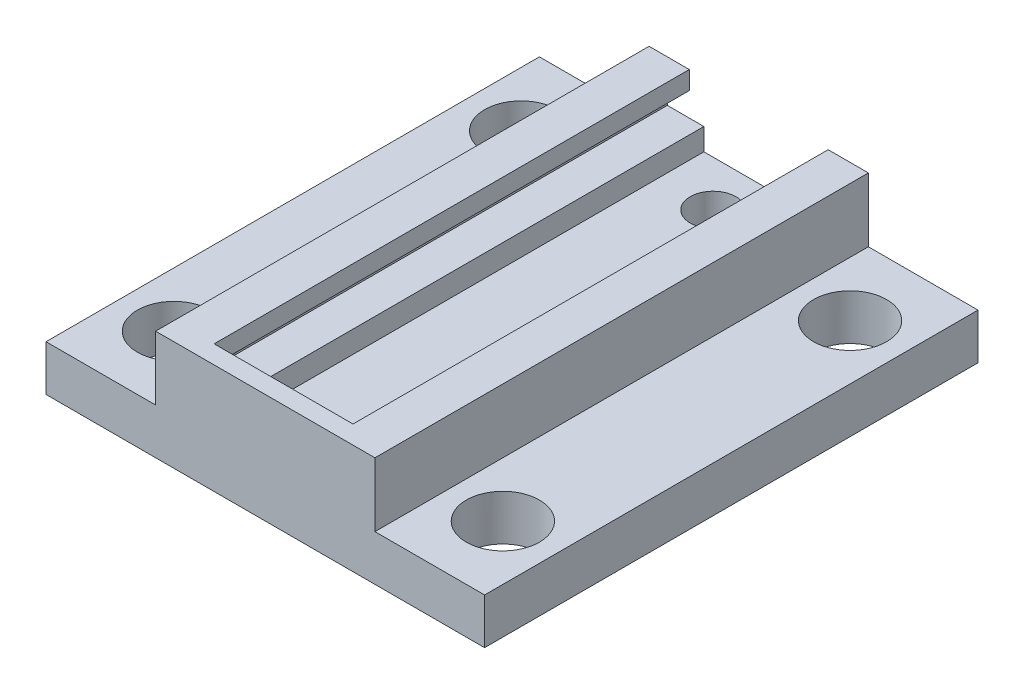
ISO-10303-21;
HEADER;
FILE_DESCRIPTION(('STEP AP214'),'2;1');
FILE_NAME('part.step','',(''),(''),'','','');
FILE_SCHEMA(('AUTOMOTIVE_DESIGN { 1 0 10303 214 1 1 1 1 }'));
ENDSEC;
DATA;
#1=APPLICATION_CONTEXT('core data for automotive mechanical design processes');
#2=APPLICATION_PROTOCOL_DEFINITION('international standard','automotive_design',2000,#1);
#3=PRODUCT_CONTEXT('',#1,'mechanical');
#4=PRODUCT('Part','Part','',(#3));
#5=PRODUCT_RELATED_PRODUCT_CATEGORY('part','',(#4));
#6=PRODUCT_DEFINITION_FORMATION('','',#4);
#7=PRODUCT_DEFINITION_CONTEXT('part definition',#1,'design');
#8=PRODUCT_DEFINITION('design','',#6,#7);
#9=PRODUCT_DEFINITION_SHAPE('','',#8);
#10=(LENGTH_UNIT() NAMED_UNIT(*) SI_UNIT(.MILLI.,.METRE.));
#11=(NAMED_UNIT(*) PLANE_ANGLE_UNIT() SI_UNIT($,.RADIAN.));
#12=(NAMED_UNIT(*) SI_UNIT($,.STERADIAN.) SOLID_ANGLE_UNIT());
#13=UNCERTAINTY_MEASURE_WITH_UNIT(LENGTH_MEASURE(1.E-05),#10,'distance_accuracy_value','');
#14=(GEOMETRIC_REPRESENTATION_CONTEXT(3) GLOBAL_UNCERTAINTY_ASSIGNED_CONTEXT((#13)) GLOBAL_UNIT_ASSIGNED_CONTEXT((#10,
#11,#12)) REPRESENTATION_CONTEXT('',''));
#15=CARTESIAN_POINT('',(0.,0.,0.));
#16=DIRECTION('',(0.,0.,1.));
#17=DIRECTION('',(1.,0.,0.));
#18=AXIS2_PLACEMENT_3D('',#15,#16,#17);
#19=CARTESIAN_POINT('',(4.826,-0.0160928441834901,34.29));
#20=DIRECTION('',(1.,0.,0.));
#21=DIRECTION('',(0.,0.,-1.));
#22=AXIS2_PLACEMENT_3D('',#19,#20,#21);
#23=PLANE('',#22);
#24=DIRECTION('',(0.,-1.,0.));
#25=VECTOR('',#24,1.);
#26=CARTESIAN_POINT('',(4.826,-0.0160928441834901,33.02));
#27=LINE('',#26,#25);
#28=CARTESIAN_POINT('',(4.826,1.25390715581651,33.02));
#29=VERTEX_POINT('',#28);
#30=CARTESIAN_POINT('',(4.826,-0.0160928441834901,33.02));
#31=VERTEX_POINT('',#30);
#32=EDGE_CURVE('E199',#29,#31,#27,.T.);
#33=ORIENTED_EDGE('',*,*,#32,.F.);
#34=DIRECTION('',(0.,0.,-1.));
#35=VECTOR('',#34,1.);
#36=CARTESIAN_POINT('',(4.826,1.25390715581651,34.29));
#37=LINE('',#36,#35);
#38=CARTESIAN_POINT('',(4.826,1.25390715581651,0.));
#39=VERTEX_POINT('',#38);
#40=EDGE_CURVE('E186',#29,#39,#37,.T.);
#41=ORIENTED_EDGE('',*,*,#40,.T.);
#42=DIRECTION('',(0.,-1.,0.));
#43=VECTOR('',#42,1.);
#44=CARTESIAN_POINT('',(4.826,-0.0160928441834901,0.));
#45=LINE('',#44,#43);
#46=CARTESIAN_POINT('',(4.826,-0.0160928441834901,0.));
#47=VERTEX_POINT('',#46);
#48=EDGE_CURVE('E218',#39,#47,#45,.T.);
#49=ORIENTED_EDGE('',*,*,#48,.T.);
#50=DIRECTION('',(0.,0.,-1.));
#51=VECTOR('',#50,1.);
#52=CARTESIAN_POINT('',(4.826,-0.0160928441834901,34.29));
#53=LINE('',#52,#51);
#54=EDGE_CURVE('E303',#31,#47,#53,.T.);
#55=ORIENTED_EDGE('',*,*,#54,.F.);
#56=EDGE_LOOP('',(#33,#41,#49,#55));
#57=FACE_BOUND('',#56,.T.);
#58=ADVANCED_FACE('F51',(#57),#23,.F.);
#59=CARTESIAN_POINT('',(6.35,-0.0160928441834901,34.29));
#60=DIRECTION('',(0.,1.,0.));
#61=DIRECTION('',(0.,0.,1.));
#62=AXIS2_PLACEMENT_3D('',#59,#60,#61);
#63=PLANE('',#62);
#64=DIRECTION('',(1.,0.,0.));
#65=VECTOR('',#64,1.);
#66=CARTESIAN_POINT('',(6.35,-0.0160928441834901,33.02));
#67=LINE('',#66,#65);
#68=CARTESIAN_POINT('',(6.35,-0.0160928441834901,33.02));
#69=VERTEX_POINT('',#68);
#70=EDGE_CURVE('E390',#31,#69,#67,.T.);
#71=ORIENTED_EDGE('',*,*,#70,.F.);
#72=ORIENTED_EDGE('',*,*,#54,.T.);
#73=DIRECTION('',(1.,0.,0.));
#74=VECTOR('',#73,1.);
#75=CARTESIAN_POINT('',(6.35,-0.0160928441834901,0.));
#76=LINE('',#75,#74);
#77=CARTESIAN_POINT('',(6.35,-0.0160928441834901,0.));
#78=VERTEX_POINT('',#77);
#79=EDGE_CURVE('E222',#47,#78,#76,.T.);
#80=ORIENTED_EDGE('',*,*,#79,.T.);
#81=DIRECTION('',(0.,0.,-1.));
#82=VECTOR('',#81,1.);
#83=CARTESIAN_POINT('',(6.35,-0.0160928441834901,34.29));
#84=LINE('',#83,#82);
#85=EDGE_CURVE('E300',#69,#78,#84,.T.);
#86=ORIENTED_EDGE('',*,*,#85,.F.);
#87=EDGE_LOOP('',(#71,#72,#80,#86));
#88=FACE_BOUND('',#87,.T.);
#89=ADVANCED_FACE('F439',(#88),#63,.F.);
#90=CARTESIAN_POINT('',(6.35,-1.66709284418349,34.29));
#91=DIRECTION('',(1.,0.,0.));
#92=DIRECTION('',(0.,0.,-1.));
#93=AXIS2_PLACEMENT_3D('',#90,#91,#92);
#94=PLANE('',#93);
#95=DIRECTION('',(0.,-1.,0.));
#96=VECTOR('',#95,1.);
#97=CARTESIAN_POINT('',(6.35,-1.66709284418349,33.02));
#98=LINE('',#97,#96);
#99=CARTESIAN_POINT('',(6.35,-1.66709284418349,33.02));
#100=VERTEX_POINT('',#99);
#101=EDGE_CURVE('E386',#69,#100,#98,.T.);
#102=ORIENTED_EDGE('',*,*,#101,.F.);
#103=ORIENTED_EDGE('',*,*,#85,.T.);
#104=DIRECTION('',(0.,-1.,0.));
#105=VECTOR('',#104,1.);
#106=CARTESIAN_POINT('',(6.35,-1.66709284418349,0.));
#107=LINE('',#106,#105);
#108=CARTESIAN_POINT('',(6.35,-1.66709284418349,0.));
#109=VERTEX_POINT('',#108);
#110=EDGE_CURVE('E226',#78,#109,#107,.T.);
#111=ORIENTED_EDGE('',*,*,#110,.T.);
#112=DIRECTION('',(0.,0.,-1.));
#113=VECTOR('',#112,1.);
#114=CARTESIAN_POINT('',(6.35,-1.66709284418349,34.29));
#115=LINE('',#114,#113);
#116=EDGE_CURVE('E297',#100,#109,#115,.T.);
#117=ORIENTED_EDGE('',*,*,#116,.F.);
#118=EDGE_LOOP('',(#102,#103,#111,#117));
#119=FACE_BOUND('',#118,.T.);
#120=ADVANCED_FACE('F443',(#119),#94,.F.);
#121=CARTESIAN_POINT('',(3.81,-1.66709284418349,34.29));
#122=DIRECTION('',(0.,-1.,0.));
#123=DIRECTION('',(0.,0.,-1.));
#124=AXIS2_PLACEMENT_3D('',#121,#122,#123);
#125=PLANE('',#124);
#126=DIRECTION('',(-1.,0.,0.));
#127=VECTOR('',#126,1.);
#128=CARTESIAN_POINT('',(3.81,-1.66709284418349,33.02));
#129=LINE('',#128,#127);
#130=CARTESIAN_POINT('',(3.81,-1.66709284418349,33.02));
#131=VERTEX_POINT('',#130);
#132=EDGE_CURVE('E382',#100,#131,#129,.T.);
#133=ORIENTED_EDGE('',*,*,#132,.F.);
#134=ORIENTED_EDGE('',*,*,#116,.T.);
#135=DIRECTION('',(-1.,0.,0.));
#136=VECTOR('',#135,1.);
#137=CARTESIAN_POINT('',(3.81,-1.66709284418349,0.));
#138=LINE('',#137,#136);
#139=CARTESIAN_POINT('',(3.81,-1.66709284418349,0.));
#140=VERTEX_POINT('',#139);
#141=EDGE_CURVE('E230',#109,#140,#138,.T.);
#142=ORIENTED_EDGE('',*,*,#141,.T.);
#143=DIRECTION('',(0.,0.,-1.));
#144=VECTOR('',#143,1.);
#145=CARTESIAN_POINT('',(3.81,-1.66709284418349,34.29));
#146=LINE('',#145,#144);
#147=EDGE_CURVE('E294',#131,#140,#146,.T.);
#148=ORIENTED_EDGE('',*,*,#147,.F.);
#149=EDGE_LOOP('',(#133,#134,#142,#148));
#150=FACE_BOUND('',#149,.T.);
#151=ADVANCED_FACE('F452',(#150),#125,.F.);
#152=CARTESIAN_POINT('',(3.81,-3.19109284418349,34.29));
#153=DIRECTION('',(1.,0.,0.));
#154=DIRECTION('',(0.,1.,0.));
#155=AXIS2_PLACEMENT_3D('',#152,#153,#154);
#156=PLANE('',#155);
#157=DIRECTION('',(0.,-1.,0.));
#158=VECTOR('',#157,1.);
#159=CARTESIAN_POINT('',(3.81,-3.19109284418349,33.02));
#160=LINE('',#159,#158);
#161=CARTESIAN_POINT('',(3.81,-3.19109284418349,33.02));
#162=VERTEX_POINT('',#161);
#163=EDGE_CURVE('E378',#131,#162,#160,.T.);
#164=ORIENTED_EDGE('',*,*,#163,.F.);
#165=ORIENTED_EDGE('',*,*,#147,.T.);
#166=DIRECTION('',(0.,-1.,0.));
#167=VECTOR('',#166,1.);
#168=CARTESIAN_POINT('',(3.81,-3.19109284418349,0.));
#169=LINE('',#168,#167);
#170=CARTESIAN_POINT('',(3.81,-3.19109284418349,0.));
#171=VERTEX_POINT('',#170);
#172=EDGE_CURVE('E234',#140,#171,#169,.T.);
#173=ORIENTED_EDGE('',*,*,#172,.T.);
#174=DIRECTION('',(0.,0.,-1.));
#175=VECTOR('',#174,1.);
#176=CARTESIAN_POINT('',(3.81,-3.19109284418349,34.29));
#177=LINE('',#176,#175);
#178=EDGE_CURVE('E291',#162,#171,#177,.T.);
#179=ORIENTED_EDGE('',*,*,#178,.F.);
#180=EDGE_LOOP('',(#164,#165,#173,#179));
#181=FACE_BOUND('',#180,.T.);
#182=ADVANCED_FACE('F457',(#181),#156,.F.);
#183=CARTESIAN_POINT('',(3.81,-3.19109284418349,34.29));
#184=DIRECTION('',(0.,-1.,0.));
#185=DIRECTION('',(0.,0.,-1.));
#186=AXIS2_PLACEMENT_3D('',#183,#184,#185);
#187=PLANE('',#186);
#188=CARTESIAN_POINT('',(0.,-3.19109284418349,3.175));
#189=DIRECTION('',(0.,1.,0.));
#190=DIRECTION('',(0.,0.,1.));
#191=AXIS2_PLACEMENT_3D('',#188,#189,#190);
#192=CIRCLE('',#191,1.5875);
#193=CARTESIAN_POINT('',(0.,-3.19109284418349,4.7625));
#194=VERTEX_POINT('',#193);
#195=EDGE_CURVE('E742',#194,#194,#192,.T.);
#196=ORIENTED_EDGE('',*,*,#195,.F.);
#197=EDGE_LOOP('',(#196));
#198=FACE_BOUND('',#197,.T.);
#199=DIRECTION('',(1.,0.,0.));
#200=VECTOR('',#199,1.);
#201=CARTESIAN_POINT('',(-7.62,-3.19109284418349,33.02));
#202=LINE('',#201,#200);
#203=CARTESIAN_POINT('',(-3.81,-3.19109284418349,33.02));
#204=VERTEX_POINT('',#203);
#205=EDGE_CURVE('E350',#204,#162,#202,.T.);
#206=ORIENTED_EDGE('',*,*,#205,.T.);
#207=ORIENTED_EDGE('',*,*,#178,.T.);
#208=DIRECTION('',(-1.,0.,0.));
#209=VECTOR('',#208,1.);
#210=CARTESIAN_POINT('',(3.81,-3.19109284418349,0.));
#211=LINE('',#210,#209);
#212=CARTESIAN_POINT('',(-3.81,-3.19109284418349,0.));
#213=VERTEX_POINT('',#212);
#214=EDGE_CURVE('E238',#171,#213,#211,.T.);
#215=ORIENTED_EDGE('',*,*,#214,.T.);
#216=DIRECTION('',(0.,0.,-1.));
#217=VECTOR('',#216,1.);
#218=CARTESIAN_POINT('',(-3.81,-3.19109284418349,34.29));
#219=LINE('',#218,#217);
#220=EDGE_CURVE('E288',#204,#213,#219,.T.);
#221=ORIENTED_EDGE('',*,*,#220,.F.);
#222=EDGE_LOOP('',(#206,#207,#215,#221));
#223=FACE_BOUND('',#222,.T.);
#224=ADVANCED_FACE('F466',(#198,#223),#187,.F.);
#225=CARTESIAN_POINT('',(-3.81,-3.19109284418349,34.29));
#226=DIRECTION('',(-1.,0.,0.));
#227=DIRECTION('',(0.,-1.,0.));
#228=AXIS2_PLACEMENT_3D('',#225,#226,#227);
#229=PLANE('',#228);
#230=DIRECTION('',(0.,1.,0.));
#231=VECTOR('',#230,1.);
#232=CARTESIAN_POINT('',(-3.81,-3.19109284418349,33.02));
#233=LINE('',#232,#231);
#234=CARTESIAN_POINT('',(-3.81,-1.66709284418349,33.02));
#235=VERTEX_POINT('',#234);
#236=EDGE_CURVE('E374',#204,#235,#233,.T.);
#237=ORIENTED_EDGE('',*,*,#236,.F.);
#238=ORIENTED_EDGE('',*,*,#220,.T.);
#239=DIRECTION('',(0.,1.,0.));
#240=VECTOR('',#239,1.);
#241=CARTESIAN_POINT('',(-3.81,-3.19109284418349,0.));
#242=LINE('',#241,#240);
#243=CARTESIAN_POINT('',(-3.81,-1.66709284418349,0.));
#244=VERTEX_POINT('',#243);
#245=EDGE_CURVE('E242',#213,#244,#242,.T.);
#246=ORIENTED_EDGE('',*,*,#245,.T.);
#247=DIRECTION('',(0.,0.,-1.));
#248=VECTOR('',#247,1.);
#249=CARTESIAN_POINT('',(-3.81,-1.66709284418349,34.29));
#250=LINE('',#249,#248);
#251=EDGE_CURVE('E285',#235,#244,#250,.T.);
#252=ORIENTED_EDGE('',*,*,#251,.F.);
#253=EDGE_LOOP('',(#237,#238,#246,#252));
#254=FACE_BOUND('',#253,.T.);
#255=ADVANCED_FACE('F470',(#254),#229,.F.);
#256=CARTESIAN_POINT('',(-3.81,-1.66709284418349,34.29));
#257=DIRECTION('',(0.,-1.,0.));
#258=DIRECTION('',(0.,0.,-1.));
#259=AXIS2_PLACEMENT_3D('',#256,#257,#258);
#260=PLANE('',#259);
#261=DIRECTION('',(-1.,0.,0.));
#262=VECTOR('',#261,1.);
#263=CARTESIAN_POINT('',(-3.81,-1.66709284418349,33.02));
#264=LINE('',#263,#262);
#265=CARTESIAN_POINT('',(-6.35,-1.66709284418349,33.02));
#266=VERTEX_POINT('',#265);
#267=EDGE_CURVE('E370',#235,#266,#264,.T.);
#268=ORIENTED_EDGE('',*,*,#267,.F.);
#269=ORIENTED_EDGE('',*,*,#251,.T.);
#270=DIRECTION('',(-1.,0.,0.));
#271=VECTOR('',#270,1.);
#272=CARTESIAN_POINT('',(-3.81,-1.66709284418349,0.));
#273=LINE('',#272,#271);
#274=CARTESIAN_POINT('',(-6.35,-1.66709284418349,0.));
#275=VERTEX_POINT('',#274);
#276=EDGE_CURVE('E246',#244,#275,#273,.T.);
#277=ORIENTED_EDGE('',*,*,#276,.T.);
#278=DIRECTION('',(0.,0.,-1.));
#279=VECTOR('',#278,1.);
#280=CARTESIAN_POINT('',(-6.35,-1.66709284418349,34.29));
#281=LINE('',#280,#279);
#282=EDGE_CURVE('E282',#266,#275,#281,.T.);
#283=ORIENTED_EDGE('',*,*,#282,.F.);
#284=EDGE_LOOP('',(#268,#269,#277,#283));
#285=FACE_BOUND('',#284,.T.);
#286=ADVANCED_FACE('F479',(#285),#260,.F.);
#287=CARTESIAN_POINT('',(-6.35,-1.66709284418349,34.29));
#288=DIRECTION('',(-1.,0.,0.));
#289=DIRECTION('',(0.,-1.,0.));
#290=AXIS2_PLACEMENT_3D('',#287,#288,#289);
#291=PLANE('',#290);
#292=DIRECTION('',(0.,1.,0.));
#293=VECTOR('',#292,1.);
#294=CARTESIAN_POINT('',(-6.35,-1.66709284418349,33.02));
#295=LINE('',#294,#293);
#296=CARTESIAN_POINT('',(-6.35,-0.0160928441834927,33.02));
#297=VERTEX_POINT('',#296);
#298=EDGE_CURVE('E366',#266,#297,#295,.T.);
#299=ORIENTED_EDGE('',*,*,#298,.F.);
#300=ORIENTED_EDGE('',*,*,#282,.T.);
#301=DIRECTION('',(0.,1.,0.));
#302=VECTOR('',#301,1.);
#303=CARTESIAN_POINT('',(-6.35,-1.66709284418349,0.));
#304=LINE('',#303,#302);
#305=CARTESIAN_POINT('',(-6.35,-0.0160928441834927,0.));
#306=VERTEX_POINT('',#305);
#307=EDGE_CURVE('E250',#275,#306,#304,.T.);
#308=ORIENTED_EDGE('',*,*,#307,.T.);
#309=DIRECTION('',(0.,0.,-1.));
#310=VECTOR('',#309,1.);
#311=CARTESIAN_POINT('',(-6.35,-0.0160928441834927,34.29));
#312=LINE('',#311,#310);
#313=EDGE_CURVE('E279',#297,#306,#312,.T.);
#314=ORIENTED_EDGE('',*,*,#313,.F.);
#315=EDGE_LOOP('',(#299,#300,#308,#314));
#316=FACE_BOUND('',#315,.T.);
#317=ADVANCED_FACE('F484',(#316),#291,.F.);
#318=CARTESIAN_POINT('',(-6.35,-0.0160928441834927,34.29));
#319=DIRECTION('',(0.,1.,0.));
#320=DIRECTION('',(0.,0.,1.));
#321=AXIS2_PLACEMENT_3D('',#318,#319,#320);
#322=PLANE('',#321);
#323=DIRECTION('',(1.,0.,0.));
#324=VECTOR('',#323,1.);
#325=CARTESIAN_POINT('',(-6.35,-0.0160928441834927,33.02));
#326=LINE('',#325,#324);
#327=CARTESIAN_POINT('',(-4.826,-0.0160928441834927,33.02));
#328=VERTEX_POINT('',#327);
#329=EDGE_CURVE('E362',#297,#328,#326,.T.);
#330=ORIENTED_EDGE('',*,*,#329,.F.);
#331=ORIENTED_EDGE('',*,*,#313,.T.);
#332=DIRECTION('',(1.,0.,0.));
#333=VECTOR('',#332,1.);
#334=CARTESIAN_POINT('',(-6.35,-0.0160928441834927,0.));
#335=LINE('',#334,#333);
#336=CARTESIAN_POINT('',(-4.826,-0.0160928441834927,0.));
#337=VERTEX_POINT('',#336);
#338=EDGE_CURVE('E254',#306,#337,#335,.T.);
#339=ORIENTED_EDGE('',*,*,#338,.T.);
#340=DIRECTION('',(0.,0.,-1.));
#341=VECTOR('',#340,1.);
#342=CARTESIAN_POINT('',(-4.826,-0.0160928441834927,34.29));
#343=LINE('',#342,#341);
#344=EDGE_CURVE('E276',#328,#337,#343,.T.);
#345=ORIENTED_EDGE('',*,*,#344,.F.);
#346=EDGE_LOOP('',(#330,#331,#339,#345));
#347=FACE_BOUND('',#346,.T.);
#348=ADVANCED_FACE('F493',(#347),#322,.F.);
#349=CARTESIAN_POINT('',(-4.826,-0.0160928441834927,34.29));
#350=DIRECTION('',(-1.,0.,0.));
#351=DIRECTION('',(0.,-1.,0.));
#352=AXIS2_PLACEMENT_3D('',#349,#350,#351);
#353=PLANE('',#352);
#354=DIRECTION('',(0.,1.,0.));
#355=VECTOR('',#354,1.);
#356=CARTESIAN_POINT('',(-4.826,-0.0160928441834927,33.02));
#357=LINE('',#356,#355);
#358=CARTESIAN_POINT('',(-4.826,1.25390715581651,33.02));
#359=VERTEX_POINT('',#358);
#360=EDGE_CURVE('E358',#328,#359,#357,.T.);
#361=ORIENTED_EDGE('',*,*,#360,.F.);
#362=ORIENTED_EDGE('',*,*,#344,.T.);
#363=DIRECTION('',(0.,1.,0.));
#364=VECTOR('',#363,1.);
#365=CARTESIAN_POINT('',(-4.826,-0.0160928441834927,0.));
#366=LINE('',#365,#364);
#367=CARTESIAN_POINT('',(-4.826,1.25390715581651,0.));
#368=VERTEX_POINT('',#367);
#369=EDGE_CURVE('E258',#337,#368,#366,.T.);
#370=ORIENTED_EDGE('',*,*,#369,.T.);
#371=DIRECTION('',(0.,0.,-1.));
#372=VECTOR('',#371,1.);
#373=CARTESIAN_POINT('',(-4.826,1.25390715581651,34.29));
#374=LINE('',#373,#372);
#375=EDGE_CURVE('E273',#359,#368,#374,.T.);
#376=ORIENTED_EDGE('',*,*,#375,.F.);
#377=EDGE_LOOP('',(#361,#362,#370,#376));
#378=FACE_BOUND('',#377,.T.);
#379=ADVANCED_FACE('F497',(#378),#353,.F.);
#380=CARTESIAN_POINT('',(-7.62,-3.19109284418349,34.29));
#381=DIRECTION('',(0.,-1.,0.));
#382=DIRECTION('',(1.,0.,0.));
#383=AXIS2_PLACEMENT_3D('',#380,#381,#382);
#384=PLANE('',#383);
#385=CARTESIAN_POINT('',(-11.43,-3.19109284418349,29.21));
#386=DIRECTION('',(0.,-1.,0.));
#387=DIRECTION('',(1.,0.,0.));
#388=AXIS2_PLACEMENT_3D('',#385,#386,#387);
#389=CIRCLE('',#388,2.54);
#390=CARTESIAN_POINT('',(-8.89,-3.19109284418349,29.21));
#391=VERTEX_POINT('',#390);
#392=EDGE_CURVE('E346',#391,#391,#389,.T.);
#393=ORIENTED_EDGE('',*,*,#392,.T.);
#394=EDGE_LOOP('',(#393));
#395=FACE_BOUND('',#394,.T.);
#396=CARTESIAN_POINT('',(-11.43,-3.19109284418349,5.08));
#397=DIRECTION('',(0.,-1.,0.));
#398=DIRECTION('',(1.,0.,0.));
#399=AXIS2_PLACEMENT_3D('',#396,#397,#398);
#400=CIRCLE('',#399,2.54);
#401=CARTESIAN_POINT('',(-8.89,-3.19109284418349,5.08));
#402=VERTEX_POINT('',#401);
#403=EDGE_CURVE('E329',#402,#402,#400,.T.);
#404=ORIENTED_EDGE('',*,*,#403,.T.);
#405=EDGE_LOOP('',(#404));
#406=FACE_BOUND('',#405,.T.);
#407=DIRECTION('',(-1.,0.,0.));
#408=VECTOR('',#407,1.);
#409=CARTESIAN_POINT('',(-7.62,-3.19109284418349,0.));
#410=LINE('',#409,#408);
#411=CARTESIAN_POINT('',(-7.62,-3.19109284418349,0.));
#412=VERTEX_POINT('',#411);
#413=CARTESIAN_POINT('',(-15.24,-3.19109284418349,0.));
#414=VERTEX_POINT('',#413);
#415=EDGE_CURVE('E195',#412,#414,#410,.T.);
#416=ORIENTED_EDGE('',*,*,#415,.T.);
#417=DIRECTION('',(0.,0.,-1.));
#418=VECTOR('',#417,1.);
#419=CARTESIAN_POINT('',(-15.24,-3.19109284418349,34.29));
#420=LINE('',#419,#418);
#421=CARTESIAN_POINT('',(-15.24,-3.19109284418349,34.29));
#422=VERTEX_POINT('',#421);
#423=EDGE_CURVE('E13',#422,#414,#420,.T.);
#424=ORIENTED_EDGE('',*,*,#423,.F.);
#425=DIRECTION('',(-1.,0.,0.));
#426=VECTOR('',#425,1.);
#427=CARTESIAN_POINT('',(-7.62,-3.19109284418349,34.29));
#428=LINE('',#427,#426);
#429=CARTESIAN_POINT('',(-7.62,-3.19109284418349,34.29));
#430=VERTEX_POINT('',#429);
#431=EDGE_CURVE('E268',#430,#422,#428,.T.);
#432=ORIENTED_EDGE('',*,*,#431,.F.);
#433=DIRECTION('',(0.,0.,-1.));
#434=VECTOR('',#433,1.);
#435=CARTESIAN_POINT('',(-7.62,-3.19109284418349,34.29));
#436=LINE('',#435,#434);
#437=EDGE_CURVE('E143',#430,#412,#436,.T.);
#438=ORIENTED_EDGE('',*,*,#437,.T.);
#439=EDGE_LOOP('',(#416,#424,#432,#438));
#440=FACE_BOUND('',#439,.T.);
#441=ADVANCED_FACE('F53',(#395,#406,#440),#384,.F.);
#442=CARTESIAN_POINT('',(-15.24,-3.19109284418349,34.29));
#443=DIRECTION('',(1.,0.,0.));
#444=DIRECTION('',(0.,0.,-1.));
#445=AXIS2_PLACEMENT_3D('',#442,#443,#444);
#446=PLANE('',#445);
#447=DIRECTION('',(0.,-1.,0.));
#448=VECTOR('',#447,1.);
#449=CARTESIAN_POINT('',(-15.24,-3.19109284418349,0.));
#450=LINE('',#449,#448);
#451=CARTESIAN_POINT('',(-15.24,-6.36609284418349,0.));
#452=VERTEX_POINT('',#451);
#453=EDGE_CURVE('E198',#414,#452,#450,.T.);
#454=ORIENTED_EDGE('',*,*,#453,.T.);
#455=DIRECTION('',(0.,0.,-1.));
#456=VECTOR('',#455,1.);
#457=CARTESIAN_POINT('',(-15.24,-6.36609284418349,34.29));
#458=LINE('',#457,#456);
#459=CARTESIAN_POINT('',(-15.24,-6.36609284418349,34.29));
#460=VERTEX_POINT('',#459);
#461=EDGE_CURVE('E62',#460,#452,#458,.T.);
#462=ORIENTED_EDGE('',*,*,#461,.F.);
#463=DIRECTION('',(0.,-1.,0.));
#464=VECTOR('',#463,1.);
#465=CARTESIAN_POINT('',(-15.24,-3.19109284418349,34.29));
#466=LINE('',#465,#464);
#467=EDGE_CURVE('E150',#422,#460,#466,.T.);
#468=ORIENTED_EDGE('',*,*,#467,.F.);
#469=ORIENTED_EDGE('',*,*,#423,.T.);
#470=EDGE_LOOP('',(#454,#462,#468,#469));
#471=FACE_BOUND('',#470,.T.);
#472=ADVANCED_FACE('F503',(#471),#446,.F.);
#473=CARTESIAN_POINT('',(15.24,-6.36609284418349,34.29));
#474=DIRECTION('',(0.,1.,0.));
#475=DIRECTION('',(-1.,0.,0.));
#476=AXIS2_PLACEMENT_3D('',#473,#474,#475);
#477=PLANE('',#476);
#478=CARTESIAN_POINT('',(0.,-6.36609284418349,3.175));
#479=DIRECTION('',(0.,1.,0.));
#480=DIRECTION('',(0.,0.,1.));
#481=AXIS2_PLACEMENT_3D('',#478,#479,#480);
#482=CIRCLE('',#481,1.5875);
#483=CARTESIAN_POINT('',(0.,-6.36609284418349,4.7625));
#484=VERTEX_POINT('',#483);
#485=EDGE_CURVE('E739',#484,#484,#482,.T.);
#486=ORIENTED_EDGE('',*,*,#485,.T.);
#487=EDGE_LOOP('',(#486));
#488=FACE_BOUND('',#487,.T.);
#489=CARTESIAN_POINT('',(11.43,-6.36609284418349,5.08));
#490=DIRECTION('',(0.,1.,0.));
#491=DIRECTION('',(0.,0.,-1.));
#492=AXIS2_PLACEMENT_3D('',#489,#490,#491);
#493=CIRCLE('',#492,2.54);
#494=CARTESIAN_POINT('',(11.43,-6.36609284418349,2.54));
#495=VERTEX_POINT('',#494);
#496=EDGE_CURVE('E341',#495,#495,#493,.T.);
#497=ORIENTED_EDGE('',*,*,#496,.T.);
#498=EDGE_LOOP('',(#497));
#499=FACE_BOUND('',#498,.T.);
#500=CARTESIAN_POINT('',(11.43,-6.36609284418349,29.21));
#501=DIRECTION('',(0.,1.,0.));
#502=DIRECTION('',(0.,0.,-1.));
#503=AXIS2_PLACEMENT_3D('',#500,#501,#502);
#504=CIRCLE('',#503,2.54);
#505=CARTESIAN_POINT('',(11.43,-6.36609284418349,26.67));
#506=VERTEX_POINT('',#505);
#507=EDGE_CURVE('E337',#506,#506,#504,.T.);
#508=ORIENTED_EDGE('',*,*,#507,.T.);
#509=EDGE_LOOP('',(#508));
#510=FACE_BOUND('',#509,.T.);
#511=CARTESIAN_POINT('',(-11.43,-6.36609284418349,29.21));
#512=DIRECTION('',(0.,1.,0.));
#513=DIRECTION('',(0.,0.,1.));
#514=AXIS2_PLACEMENT_3D('',#511,#512,#513);
#515=CIRCLE('',#514,2.54);
#516=CARTESIAN_POINT('',(-11.43,-6.36609284418349,31.75));
#517=VERTEX_POINT('',#516);
#518=EDGE_CURVE('E331',#517,#517,#515,.T.);
#519=ORIENTED_EDGE('',*,*,#518,.T.);
#520=EDGE_LOOP('',(#519));
#521=FACE_BOUND('',#520,.T.);
#522=CARTESIAN_POINT('',(-11.43,-6.36609284418349,5.08));
#523=DIRECTION('',(0.,1.,0.));
#524=DIRECTION('',(0.,0.,1.));
#525=AXIS2_PLACEMENT_3D('',#522,#523,#524);
#526=CIRCLE('',#525,2.54);
#527=CARTESIAN_POINT('',(-11.43,-6.36609284418349,7.62));
#528=VERTEX_POINT('',#527);
#529=EDGE_CURVE('E323',#528,#528,#526,.T.);
#530=ORIENTED_EDGE('',*,*,#529,.T.);
#531=EDGE_LOOP('',(#530));
#532=FACE_BOUND('',#531,.T.);
#533=DIRECTION('',(1.,0.,0.));
#534=VECTOR('',#533,1.);
#535=CARTESIAN_POINT('',(15.24,-6.36609284418349,0.));
#536=LINE('',#535,#534);
#537=CARTESIAN_POINT('',(15.24,-6.36609284418349,0.));
#538=VERTEX_POINT('',#537);
#539=EDGE_CURVE('E203',#452,#538,#536,.T.);
#540=ORIENTED_EDGE('',*,*,#539,.T.);
#541=DIRECTION('',(0.,0.,-1.));
#542=VECTOR('',#541,1.);
#543=CARTESIAN_POINT('',(15.24,-6.36609284418349,34.29));
#544=LINE('',#543,#542);
#545=CARTESIAN_POINT('',(15.24,-6.36609284418349,34.29));
#546=VERTEX_POINT('',#545);
#547=EDGE_CURVE('E314',#546,#538,#544,.T.);
#548=ORIENTED_EDGE('',*,*,#547,.F.);
#549=DIRECTION('',(1.,0.,0.));
#550=VECTOR('',#549,1.);
#551=CARTESIAN_POINT('',(-15.24,-6.36609284418349,34.29));
#552=LINE('',#551,#550);
#553=EDGE_CURVE('E401',#460,#546,#552,.T.);
#554=ORIENTED_EDGE('',*,*,#553,.F.);
#555=ORIENTED_EDGE('',*,*,#461,.T.);
#556=EDGE_LOOP('',(#540,#548,#554,#555));
#557=FACE_BOUND('',#556,.T.);
#558=ADVANCED_FACE('F505',(#488,#499,#510,#521,#532,#557),#477,.F.);
#559=CARTESIAN_POINT('',(15.24,-3.19109284418349,34.29));
#560=DIRECTION('',(-1.,0.,0.));
#561=DIRECTION('',(0.,0.,1.));
#562=AXIS2_PLACEMENT_3D('',#559,#560,#561);
#563=PLANE('',#562);
#564=DIRECTION('',(0.,1.,0.));
#565=VECTOR('',#564,1.);
#566=CARTESIAN_POINT('',(15.24,-3.19109284418349,0.));
#567=LINE('',#566,#565);
#568=CARTESIAN_POINT('',(15.24,-3.19109284418349,0.));
#569=VERTEX_POINT('',#568);
#570=EDGE_CURVE('E206',#538,#569,#567,.T.);
#571=ORIENTED_EDGE('',*,*,#570,.T.);
#572=DIRECTION('',(0.,0.,-1.));
#573=VECTOR('',#572,1.);
#574=CARTESIAN_POINT('',(15.24,-3.19109284418349,34.29));
#575=LINE('',#574,#573);
#576=CARTESIAN_POINT('',(15.24,-3.19109284418349,34.29));
#577=VERTEX_POINT('',#576);
#578=EDGE_CURVE('E310',#577,#569,#575,.T.);
#579=ORIENTED_EDGE('',*,*,#578,.F.);
#580=DIRECTION('',(0.,1.,0.));
#581=VECTOR('',#580,1.);
#582=CARTESIAN_POINT('',(15.24,-3.19109284418349,34.29));
#583=LINE('',#582,#581);
#584=EDGE_CURVE('E404',#546,#577,#583,.T.);
#585=ORIENTED_EDGE('',*,*,#584,.F.);
#586=ORIENTED_EDGE('',*,*,#547,.T.);
#587=EDGE_LOOP('',(#571,#579,#585,#586));
#588=FACE_BOUND('',#587,.T.);
#589=ADVANCED_FACE('F412',(#588),#563,.F.);
#590=CARTESIAN_POINT('',(7.62,-3.19109284418349,34.29));
#591=DIRECTION('',(0.,-1.,0.));
#592=DIRECTION('',(1.,0.,0.));
#593=AXIS2_PLACEMENT_3D('',#590,#591,#592);
#594=PLANE('',#593);
#595=CARTESIAN_POINT('',(11.43,-3.19109284418349,5.08));
#596=DIRECTION('',(0.,-1.,0.));
#597=DIRECTION('',(1.,0.,0.));
#598=AXIS2_PLACEMENT_3D('',#595,#596,#597);
#599=CIRCLE('',#598,2.54);
#600=CARTESIAN_POINT('',(13.97,-3.19109284418349,5.08));
#601=VERTEX_POINT('',#600);
#602=EDGE_CURVE('E55',#601,#601,#599,.T.);
#603=ORIENTED_EDGE('',*,*,#602,.T.);
#604=EDGE_LOOP('',(#603));
#605=FACE_BOUND('',#604,.T.);
#606=CARTESIAN_POINT('',(11.43,-3.19109284418349,29.21));
#607=DIRECTION('',(0.,-1.,0.));
#608=DIRECTION('',(1.,0.,0.));
#609=AXIS2_PLACEMENT_3D('',#606,#607,#608);
#610=CIRCLE('',#609,2.54);
#611=CARTESIAN_POINT('',(13.97,-3.19109284418349,29.21));
#612=VERTEX_POINT('',#611);
#613=EDGE_CURVE('E320',#612,#612,#610,.T.);
#614=ORIENTED_EDGE('',*,*,#613,.T.);
#615=EDGE_LOOP('',(#614));
#616=FACE_BOUND('',#615,.T.);
#617=DIRECTION('',(-1.,0.,0.));
#618=VECTOR('',#617,1.);
#619=CARTESIAN_POINT('',(7.62,-3.19109284418349,0.));
#620=LINE('',#619,#618);
#621=CARTESIAN_POINT('',(7.62,-3.19109284418349,0.));
#622=VERTEX_POINT('',#621);
#623=EDGE_CURVE('E209',#569,#622,#620,.T.);
#624=ORIENTED_EDGE('',*,*,#623,.T.);
#625=DIRECTION('',(0.,0.,-1.));
#626=VECTOR('',#625,1.);
#627=CARTESIAN_POINT('',(7.62,-3.19109284418349,34.29));
#628=LINE('',#627,#626);
#629=CARTESIAN_POINT('',(7.62,-3.19109284418349,34.29));
#630=VERTEX_POINT('',#629);
#631=EDGE_CURVE('E185',#630,#622,#628,.T.);
#632=ORIENTED_EDGE('',*,*,#631,.F.);
#633=DIRECTION('',(-1.,0.,0.));
#634=VECTOR('',#633,1.);
#635=CARTESIAN_POINT('',(7.62,-3.19109284418349,34.29));
#636=LINE('',#635,#634);
#637=EDGE_CURVE('E171',#577,#630,#636,.T.);
#638=ORIENTED_EDGE('',*,*,#637,.F.);
#639=ORIENTED_EDGE('',*,*,#578,.T.);
#640=EDGE_LOOP('',(#624,#632,#638,#639));
#641=FACE_BOUND('',#640,.T.);
#642=ADVANCED_FACE('F416',(#605,#616,#641),#594,.F.);
#643=CARTESIAN_POINT('',(7.62,1.25390715581651,34.29));
#644=DIRECTION('',(-1.,0.,0.));
#645=DIRECTION('',(0.,0.,1.));
#646=AXIS2_PLACEMENT_3D('',#643,#644,#645);
#647=PLANE('',#646);
#648=ORIENTED_EDGE('',*,*,#631,.T.);
#649=DIRECTION('',(0.,1.,0.));
#650=VECTOR('',#649,1.);
#651=CARTESIAN_POINT('',(7.62,1.25390715581651,0.));
#652=LINE('',#651,#650);
#653=CARTESIAN_POINT('',(7.62,1.25390715581651,0.));
#654=VERTEX_POINT('',#653);
#655=EDGE_CURVE('E180',#622,#654,#652,.T.);
#656=ORIENTED_EDGE('',*,*,#655,.T.);
#657=DIRECTION('',(0.,0.,-1.));
#658=VECTOR('',#657,1.);
#659=CARTESIAN_POINT('',(7.62,1.25390715581651,34.29));
#660=LINE('',#659,#658);
#661=CARTESIAN_POINT('',(7.62,1.25390715581651,34.29));
#662=VERTEX_POINT('',#661);
#663=EDGE_CURVE('E177',#662,#654,#660,.T.);
#664=ORIENTED_EDGE('',*,*,#663,.F.);
#665=DIRECTION('',(0.,1.,0.));
#666=VECTOR('',#665,1.);
#667=CARTESIAN_POINT('',(7.62,1.25390715581651,34.29));
#668=LINE('',#667,#666);
#669=EDGE_CURVE('E165',#630,#662,#668,.T.);
#670=ORIENTED_EDGE('',*,*,#669,.F.);
#671=EDGE_LOOP('',(#648,#656,#664,#670));
#672=FACE_BOUND('',#671,.T.);
#673=ADVANCED_FACE('F178',(#672),#647,.F.);
#674=CARTESIAN_POINT('',(-4.826,1.25390715581651,34.29));
#675=DIRECTION('',(0.,-1.,0.));
#676=DIRECTION('',(1.,0.,0.));
#677=AXIS2_PLACEMENT_3D('',#674,#675,#676);
#678=PLANE('',#677);
#679=DIRECTION('',(0.,0.,-1.));
#680=VECTOR('',#679,1.);
#681=CARTESIAN_POINT('',(-7.62,1.25390715581651,34.29));
#682=LINE('',#681,#680);
#683=CARTESIAN_POINT('',(-7.62,1.25390715581651,34.29));
#684=VERTEX_POINT('',#683);
#685=CARTESIAN_POINT('',(-7.62,1.25390715581651,0.));
#686=VERTEX_POINT('',#685);
#687=EDGE_CURVE('E136',#684,#686,#682,.T.);
#688=ORIENTED_EDGE('',*,*,#687,.F.);
#689=DIRECTION('',(-1.,0.,0.));
#690=VECTOR('',#689,1.);
#691=CARTESIAN_POINT('',(4.826,1.25390715581651,34.29));
#692=LINE('',#691,#690);
#693=EDGE_CURVE('E169',#662,#684,#692,.T.);
#694=ORIENTED_EDGE('',*,*,#693,.F.);
#695=ORIENTED_EDGE('',*,*,#663,.T.);
#696=DIRECTION('',(-1.,0.,0.));
#697=VECTOR('',#696,1.);
#698=CARTESIAN_POINT('',(4.826,1.25390715581651,0.));
#699=LINE('',#698,#697);
#700=EDGE_CURVE('E215',#654,#39,#699,.T.);
#701=ORIENTED_EDGE('',*,*,#700,.T.);
#702=ORIENTED_EDGE('',*,*,#40,.F.);
#703=DIRECTION('',(-1.,0.,0.));
#704=VECTOR('',#703,1.);
#705=CARTESIAN_POINT('',(-7.62,1.25390715581651,33.02));
#706=LINE('',#705,#704);
#707=EDGE_CURVE('E354',#29,#359,#706,.T.);
#708=ORIENTED_EDGE('',*,*,#707,.T.);
#709=ORIENTED_EDGE('',*,*,#375,.T.);
#710=DIRECTION('',(-1.,0.,0.));
#711=VECTOR('',#710,1.);
#712=CARTESIAN_POINT('',(-4.826,1.25390715581651,0.));
#713=LINE('',#712,#711);
#714=EDGE_CURVE('E262',#368,#686,#713,.T.);
#715=ORIENTED_EDGE('',*,*,#714,.T.);
#716=EDGE_LOOP('',(#688,#694,#695,#701,#702,#708,#709,#715));
#717=FACE_BOUND('',#716,.T.);
#718=ADVANCED_FACE('F188',(#717),#678,.F.);
#719=CARTESIAN_POINT('',(-7.62,1.25390715581651,34.29));
#720=DIRECTION('',(1.,0.,0.));
#721=DIRECTION('',(0.,1.,0.));
#722=AXIS2_PLACEMENT_3D('',#719,#720,#721);
#723=PLANE('',#722);
#724=ORIENTED_EDGE('',*,*,#687,.T.);
#725=DIRECTION('',(0.,-1.,0.));
#726=VECTOR('',#725,1.);
#727=CARTESIAN_POINT('',(-7.62,1.25390715581651,0.));
#728=LINE('',#727,#726);
#729=EDGE_CURVE('E265',#686,#412,#728,.T.);
#730=ORIENTED_EDGE('',*,*,#729,.T.);
#731=ORIENTED_EDGE('',*,*,#437,.F.);
#732=DIRECTION('',(0.,-1.,0.));
#733=VECTOR('',#732,1.);
#734=CARTESIAN_POINT('',(-7.62,1.25390715581651,34.29));
#735=LINE('',#734,#733);
#736=EDGE_CURVE('E71',#684,#430,#735,.T.);
#737=ORIENTED_EDGE('',*,*,#736,.F.);
#738=EDGE_LOOP('',(#724,#730,#731,#737));
#739=FACE_BOUND('',#738,.T.);
#740=ADVANCED_FACE('F501',(#739),#723,.F.);
#741=CARTESIAN_POINT('',(0.,0.,34.29));
#742=DIRECTION('',(0.,0.,1.));
#743=DIRECTION('',(1.,0.,0.));
#744=AXIS2_PLACEMENT_3D('',#741,#742,#743);
#745=PLANE('',#744);
#746=ORIENTED_EDGE('',*,*,#693,.T.);
#747=ORIENTED_EDGE('',*,*,#736,.T.);
#748=ORIENTED_EDGE('',*,*,#431,.T.);
#749=ORIENTED_EDGE('',*,*,#467,.T.);
#750=ORIENTED_EDGE('',*,*,#553,.T.);
#751=ORIENTED_EDGE('',*,*,#584,.T.);
#752=ORIENTED_EDGE('',*,*,#637,.T.);
#753=ORIENTED_EDGE('',*,*,#669,.T.);
#754=EDGE_LOOP('',(#746,#747,#748,#749,#750,#751,#752,#753));
#755=FACE_BOUND('',#754,.T.);
#756=ADVANCED_FACE('F167',(#755),#745,.T.);
#757=CARTESIAN_POINT('',(0.,0.,0.));
#758=DIRECTION('',(0.,0.,1.));
#759=DIRECTION('',(1.,0.,0.));
#760=AXIS2_PLACEMENT_3D('',#757,#758,#759);
#761=PLANE('',#760);
#762=ORIENTED_EDGE('',*,*,#415,.F.);
#763=ORIENTED_EDGE('',*,*,#729,.F.);
#764=ORIENTED_EDGE('',*,*,#714,.F.);
#765=ORIENTED_EDGE('',*,*,#369,.F.);
#766=ORIENTED_EDGE('',*,*,#338,.F.);
#767=ORIENTED_EDGE('',*,*,#307,.F.);
#768=ORIENTED_EDGE('',*,*,#276,.F.);
#769=ORIENTED_EDGE('',*,*,#245,.F.);
#770=ORIENTED_EDGE('',*,*,#214,.F.);
#771=ORIENTED_EDGE('',*,*,#172,.F.);
#772=ORIENTED_EDGE('',*,*,#141,.F.);
#773=ORIENTED_EDGE('',*,*,#110,.F.);
#774=ORIENTED_EDGE('',*,*,#79,.F.);
#775=ORIENTED_EDGE('',*,*,#48,.F.);
#776=ORIENTED_EDGE('',*,*,#700,.F.);
#777=ORIENTED_EDGE('',*,*,#655,.F.);
#778=ORIENTED_EDGE('',*,*,#623,.F.);
#779=ORIENTED_EDGE('',*,*,#570,.F.);
#780=ORIENTED_EDGE('',*,*,#539,.F.);
#781=ORIENTED_EDGE('',*,*,#453,.F.);
#782=EDGE_LOOP('',(#762,#763,#764,#765,#766,#767,#768,#769,#770,#771,#772,#773,#774,#775,#776,
#777,#778,#779,#780,#781));
#783=FACE_BOUND('',#782,.T.);
#784=ADVANCED_FACE('F419',(#783),#761,.F.);
#785=CARTESIAN_POINT('',(0.,0.,33.02));
#786=DIRECTION('',(0.,0.,1.));
#787=DIRECTION('',(1.,0.,0.));
#788=AXIS2_PLACEMENT_3D('',#785,#786,#787);
#789=PLANE('',#788);
#790=ORIENTED_EDGE('',*,*,#707,.F.);
#791=ORIENTED_EDGE('',*,*,#32,.T.);
#792=ORIENTED_EDGE('',*,*,#70,.T.);
#793=ORIENTED_EDGE('',*,*,#101,.T.);
#794=ORIENTED_EDGE('',*,*,#132,.T.);
#795=ORIENTED_EDGE('',*,*,#163,.T.);
#796=ORIENTED_EDGE('',*,*,#205,.F.);
#797=ORIENTED_EDGE('',*,*,#236,.T.);
#798=ORIENTED_EDGE('',*,*,#267,.T.);
#799=ORIENTED_EDGE('',*,*,#298,.T.);
#800=ORIENTED_EDGE('',*,*,#329,.T.);
#801=ORIENTED_EDGE('',*,*,#360,.T.);
#802=EDGE_LOOP('',(#790,#791,#792,#793,#794,#795,#796,#797,#798,#799,#800,#801));
#803=FACE_BOUND('',#802,.T.);
#804=ADVANCED_FACE('F434',(#803),#789,.F.);
#805=CARTESIAN_POINT('',(11.43,-6.36609284418349,29.21));
#806=DIRECTION('',(0.,1.,0.));
#807=DIRECTION('',(0.,0.,1.));
#808=AXIS2_PLACEMENT_3D('',#805,#806,#807);
#809=CYLINDRICAL_SURFACE('',#808,2.54);
#810=ORIENTED_EDGE('',*,*,#507,.F.);
#811=EDGE_LOOP('',(#810));
#812=FACE_BOUND('',#811,.T.);
#813=ORIENTED_EDGE('',*,*,#613,.F.);
#814=EDGE_LOOP('',(#813));
#815=FACE_BOUND('',#814,.T.);
#816=ADVANCED_FACE('F535',(#812,#815),#809,.F.);
#817=CARTESIAN_POINT('',(11.43,-6.36609284418349,5.08));
#818=DIRECTION('',(0.,1.,0.));
#819=DIRECTION('',(0.,0.,1.));
#820=AXIS2_PLACEMENT_3D('',#817,#818,#819);
#821=CYLINDRICAL_SURFACE('',#820,2.54);
#822=ORIENTED_EDGE('',*,*,#496,.F.);
#823=EDGE_LOOP('',(#822));
#824=FACE_BOUND('',#823,.T.);
#825=ORIENTED_EDGE('',*,*,#602,.F.);
#826=EDGE_LOOP('',(#825));
#827=FACE_BOUND('',#826,.T.);
#828=ADVANCED_FACE('F532',(#824,#827),#821,.F.);
#829=CARTESIAN_POINT('',(-11.43,-6.36609284418349,5.08));
#830=DIRECTION('',(0.,1.,0.));
#831=DIRECTION('',(0.,0.,1.));
#832=AXIS2_PLACEMENT_3D('',#829,#830,#831);
#833=CYLINDRICAL_SURFACE('',#832,2.54);
#834=ORIENTED_EDGE('',*,*,#529,.F.);
#835=EDGE_LOOP('',(#834));
#836=FACE_BOUND('',#835,.T.);
#837=ORIENTED_EDGE('',*,*,#403,.F.);
#838=EDGE_LOOP('',(#837));
#839=FACE_BOUND('',#838,.T.);
#840=ADVANCED_FACE('F534',(#836,#839),#833,.F.);
#841=CARTESIAN_POINT('',(-11.43,-6.36609284418349,29.21));
#842=DIRECTION('',(0.,1.,0.));
#843=DIRECTION('',(0.,0.,1.));
#844=AXIS2_PLACEMENT_3D('',#841,#842,#843);
#845=CYLINDRICAL_SURFACE('',#844,2.54);
#846=ORIENTED_EDGE('',*,*,#518,.F.);
#847=EDGE_LOOP('',(#846));
#848=FACE_BOUND('',#847,.T.);
#849=ORIENTED_EDGE('',*,*,#392,.F.);
#850=EDGE_LOOP('',(#849));
#851=FACE_BOUND('',#850,.T.);
#852=ADVANCED_FACE('F542',(#848,#851),#845,.F.);
#853=CARTESIAN_POINT('',(0.,-6.36609284418349,3.175));
#854=DIRECTION('',(0.,1.,0.));
#855=DIRECTION('',(0.,0.,1.));
#856=AXIS2_PLACEMENT_3D('',#853,#854,#855);
#857=CYLINDRICAL_SURFACE('',#856,1.5875);
#858=ORIENTED_EDGE('',*,*,#485,.F.);
#859=EDGE_LOOP('',(#858));
#860=FACE_BOUND('',#859,.T.);
#861=ORIENTED_EDGE('',*,*,#195,.T.);
#862=EDGE_LOOP('',(#861));
#863=FACE_BOUND('',#862,.T.);
#864=ADVANCED_FACE('F716',(#860,#863),#857,.F.);
#865=CLOSED_SHELL('',(#58,#89,#120,#151,#182,#224,#255,#286,#317,#348,#379,#441,#472,#558,#589,
#642,#673,#718,#740,#756,#784,#804,#816,#828,#840,#852,#864));
#866=MANIFOLD_SOLID_BREP('B2',#865);
#867=ADVANCED_BREP_SHAPE_REPRESENTATION('',(#18,#866),#14);
#868=SHAPE_DEFINITION_REPRESENTATION(#9,#867);
ENDSEC;
END-ISO-10303-21;
